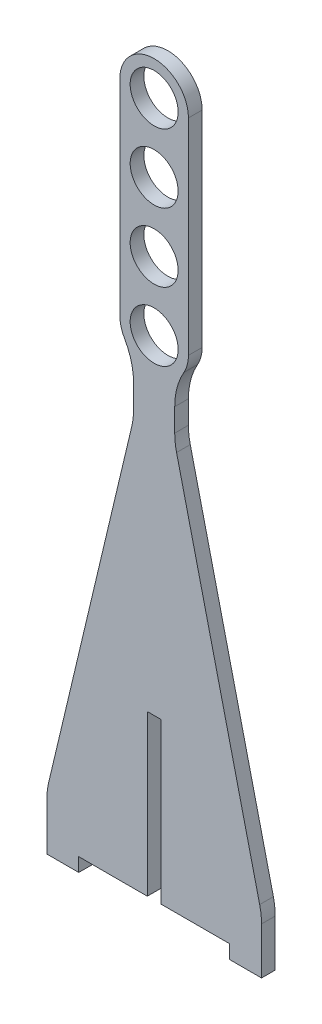
ISO-10303-21;
HEADER;
FILE_DESCRIPTION(('STEP AP214'),'2;1');
FILE_NAME('part.step','',(''),(''),'','','');
FILE_SCHEMA(('AUTOMOTIVE_DESIGN { 1 0 10303 214 1 1 1 1 }'));
ENDSEC;
DATA;
#1=APPLICATION_CONTEXT('core data for automotive mechanical design processes');
#2=APPLICATION_PROTOCOL_DEFINITION('international standard','automotive_design',2000,#1);
#3=PRODUCT_CONTEXT('',#1,'mechanical');
#4=PRODUCT('Part','Part','',(#3));
#5=PRODUCT_RELATED_PRODUCT_CATEGORY('part','',(#4));
#6=PRODUCT_DEFINITION_FORMATION('','',#4);
#7=PRODUCT_DEFINITION_CONTEXT('part definition',#1,'design');
#8=PRODUCT_DEFINITION('design','',#6,#7);
#9=PRODUCT_DEFINITION_SHAPE('','',#8);
#10=(LENGTH_UNIT() NAMED_UNIT(*) SI_UNIT(.MILLI.,.METRE.));
#11=(NAMED_UNIT(*) PLANE_ANGLE_UNIT() SI_UNIT($,.RADIAN.));
#12=(NAMED_UNIT(*) SI_UNIT($,.STERADIAN.) SOLID_ANGLE_UNIT());
#13=UNCERTAINTY_MEASURE_WITH_UNIT(LENGTH_MEASURE(1.E-05),#10,'distance_accuracy_value','');
#14=(GEOMETRIC_REPRESENTATION_CONTEXT(3) GLOBAL_UNCERTAINTY_ASSIGNED_CONTEXT((#13)) GLOBAL_UNIT_ASSIGNED_CONTEXT((#10,
#11,#12)) REPRESENTATION_CONTEXT('',''));
#15=CARTESIAN_POINT('',(0.,0.,0.));
#16=DIRECTION('',(0.,0.,1.));
#17=DIRECTION('',(1.,0.,0.));
#18=AXIS2_PLACEMENT_3D('',#15,#16,#17);
#19=CARTESIAN_POINT('',(-16.5,3.,3.));
#20=DIRECTION('',(0.,1.,0.));
#21=DIRECTION('',(0.,0.,1.));
#22=AXIS2_PLACEMENT_3D('',#19,#20,#21);
#23=PLANE('',#22);
#24=DIRECTION('',(1.,0.,0.));
#25=VECTOR('',#24,1.);
#26=CARTESIAN_POINT('',(-16.5,3.,0.));
#27=LINE('',#26,#25);
#28=CARTESIAN_POINT('',(-16.5,3.,0.));
#29=VERTEX_POINT('',#28);
#30=CARTESIAN_POINT('',(-1.5,3.,0.));
#31=VERTEX_POINT('',#30);
#32=EDGE_CURVE('E231',#29,#31,#27,.T.);
#33=ORIENTED_EDGE('',*,*,#32,.T.);
#34=DIRECTION('',(0.,0.,1.));
#35=VECTOR('',#34,1.);
#36=CARTESIAN_POINT('',(-1.5,3.,0.));
#37=LINE('',#36,#35);
#38=CARTESIAN_POINT('',(-1.5,3.,3.));
#39=VERTEX_POINT('',#38);
#40=EDGE_CURVE('E212',#31,#39,#37,.T.);
#41=ORIENTED_EDGE('',*,*,#40,.T.);
#42=DIRECTION('',(1.,0.,0.));
#43=VECTOR('',#42,1.);
#44=CARTESIAN_POINT('',(-16.5,3.,3.));
#45=LINE('',#44,#43);
#46=CARTESIAN_POINT('',(-16.5,3.,3.));
#47=VERTEX_POINT('',#46);
#48=EDGE_CURVE('E363',#47,#39,#45,.T.);
#49=ORIENTED_EDGE('',*,*,#48,.F.);
#50=DIRECTION('',(0.,0.,-1.));
#51=VECTOR('',#50,1.);
#52=CARTESIAN_POINT('',(-16.5,3.,3.));
#53=LINE('',#52,#51);
#54=EDGE_CURVE('E237',#47,#29,#53,.T.);
#55=ORIENTED_EDGE('',*,*,#54,.T.);
#56=EDGE_LOOP('',(#33,#41,#49,#55));
#57=FACE_BOUND('',#56,.T.);
#58=ADVANCED_FACE('F39',(#57),#23,.F.);
#59=CARTESIAN_POINT('',(0.,110.,3.));
#60=DIRECTION('',(0.,0.,1.));
#61=DIRECTION('',(1.,0.,0.));
#62=AXIS2_PLACEMENT_3D('',#59,#60,#61);
#63=PLANE('',#62);
#64=DIRECTION('',(0.,-1.,0.));
#65=VECTOR('',#64,1.);
#66=CARTESIAN_POINT('',(-1.5,38.,3.));
#67=LINE('',#66,#65);
#68=CARTESIAN_POINT('',(-1.5,38.,3.));
#69=VERTEX_POINT('',#68);
#70=EDGE_CURVE('E218',#69,#39,#67,.T.);
#71=ORIENTED_EDGE('',*,*,#70,.F.);
#72=DIRECTION('',(-1.,0.,0.));
#73=VECTOR('',#72,1.);
#74=CARTESIAN_POINT('',(1.5,38.,3.));
#75=LINE('',#74,#73);
#76=CARTESIAN_POINT('',(1.5,38.,3.));
#77=VERTEX_POINT('',#76);
#78=EDGE_CURVE('E233',#77,#69,#75,.T.);
#79=ORIENTED_EDGE('',*,*,#78,.F.);
#80=DIRECTION('',(0.,1.,0.));
#81=VECTOR('',#80,1.);
#82=CARTESIAN_POINT('',(1.5,38.,3.));
#83=LINE('',#82,#81);
#84=CARTESIAN_POINT('',(1.5,3.,3.));
#85=VERTEX_POINT('',#84);
#86=EDGE_CURVE('E447',#85,#77,#83,.T.);
#87=ORIENTED_EDGE('',*,*,#86,.F.);
#88=CARTESIAN_POINT('',(16.5,3.,3.));
#89=VERTEX_POINT('',#88);
#90=EDGE_CURVE('E362',#85,#89,#45,.T.);
#91=ORIENTED_EDGE('',*,*,#90,.T.);
#92=DIRECTION('',(0.,-1.,0.));
#93=VECTOR('',#92,1.);
#94=CARTESIAN_POINT('',(16.5,0.,3.));
#95=LINE('',#94,#93);
#96=CARTESIAN_POINT('',(16.5,0.,3.));
#97=VERTEX_POINT('',#96);
#98=EDGE_CURVE('E365',#89,#97,#95,.T.);
#99=ORIENTED_EDGE('',*,*,#98,.T.);
#100=DIRECTION('',(1.,0.,0.));
#101=VECTOR('',#100,1.);
#102=CARTESIAN_POINT('',(23.5,0.,3.));
#103=LINE('',#102,#101);
#104=CARTESIAN_POINT('',(23.5,0.,3.));
#105=VERTEX_POINT('',#104);
#106=EDGE_CURVE('E253',#97,#105,#103,.T.);
#107=ORIENTED_EDGE('',*,*,#106,.T.);
#108=DIRECTION('',(0.,1.,0.));
#109=VECTOR('',#108,1.);
#110=CARTESIAN_POINT('',(23.5,0.,3.));
#111=LINE('',#110,#109);
#112=CARTESIAN_POINT('',(23.5,10.2431840189314,3.));
#113=VERTEX_POINT('',#112);
#114=EDGE_CURVE('E248',#105,#113,#111,.T.);
#115=ORIENTED_EDGE('',*,*,#114,.T.);
#116=CARTESIAN_POINT('',(8.5,10.2431840189314,3.));
#117=DIRECTION('',(0.,0.,1.));
#118=DIRECTION('',(1.,0.,0.));
#119=AXIS2_PLACEMENT_3D('',#116,#117,#118);
#120=CIRCLE('',#119,15.);
#121=CARTESIAN_POINT('',(23.0940482607934,13.7092704808699,3.));
#122=VERTEX_POINT('',#121);
#123=EDGE_CURVE('E302',#113,#122,#120,.T.);
#124=ORIENTED_EDGE('',*,*,#123,.T.);
#125=DIRECTION('',(-0.231072430795896,0.972936550719561,0.));
#126=VECTOR('',#125,1.);
#127=CARTESIAN_POINT('',(23.5,12.,3.));
#128=LINE('',#127,#126);
#129=CARTESIAN_POINT('',(4.90595173920659,90.2907295191301,3.));
#130=VERTEX_POINT('',#129);
#131=EDGE_CURVE('E484',#122,#130,#128,.T.);
#132=ORIENTED_EDGE('',*,*,#131,.T.);
#133=CARTESIAN_POINT('',(19.5,93.7568159810686,3.));
#134=DIRECTION('',(0.,0.,1.));
#135=DIRECTION('',(1.,0.,0.));
#136=AXIS2_PLACEMENT_3D('',#133,#134,#135);
#137=CIRCLE('',#136,15.);
#138=CARTESIAN_POINT('',(4.5,93.7568159810686,3.));
#139=VERTEX_POINT('',#138);
#140=EDGE_CURVE('E321',#130,#139,#137,.F.);
#141=ORIENTED_EDGE('',*,*,#140,.T.);
#142=DIRECTION('',(0.,1.,0.));
#143=VECTOR('',#142,1.);
#144=CARTESIAN_POINT('',(4.5,92.,3.));
#145=LINE('',#144,#143);
#146=CARTESIAN_POINT('',(4.5,98.7750278396782,3.));
#147=VERTEX_POINT('',#146);
#148=EDGE_CURVE('E487',#139,#147,#145,.T.);
#149=ORIENTED_EDGE('',*,*,#148,.T.);
#150=CARTESIAN_POINT('',(19.5,98.7750278396782,3.));
#151=DIRECTION('',(0.,0.,1.));
#152=DIRECTION('',(1.,0.,0.));
#153=AXIS2_PLACEMENT_3D('',#150,#151,#152);
#154=CIRCLE('',#153,15.);
#155=CARTESIAN_POINT('',(6.50000000000001,106.258342613226,3.));
#156=VERTEX_POINT('',#155);
#157=EDGE_CURVE('E325',#147,#156,#154,.F.);
#158=ORIENTED_EDGE('',*,*,#157,.T.);
#159=CARTESIAN_POINT('',(0.,110.,3.));
#160=DIRECTION('',(0.,0.,1.));
#161=DIRECTION('',(1.,0.,0.));
#162=AXIS2_PLACEMENT_3D('',#159,#160,#161);
#163=CIRCLE('',#162,7.5);
#164=CARTESIAN_POINT('',(7.5,110.,3.));
#165=VERTEX_POINT('',#164);
#166=EDGE_CURVE('E490',#156,#165,#163,.T.);
#167=ORIENTED_EDGE('',*,*,#166,.T.);
#168=DIRECTION('',(0.,1.,0.));
#169=VECTOR('',#168,1.);
#170=CARTESIAN_POINT('',(7.5,110.,3.));
#171=LINE('',#170,#169);
#172=CARTESIAN_POINT('',(7.4999999999999,155.,3.));
#173=VERTEX_POINT('',#172);
#174=EDGE_CURVE('E492',#165,#173,#171,.T.);
#175=ORIENTED_EDGE('',*,*,#174,.T.);
#176=CARTESIAN_POINT('',(-1.02907469966573E-13,155.,3.));
#177=DIRECTION('',(0.,0.,1.));
#178=DIRECTION('',(-1.,0.,0.));
#179=AXIS2_PLACEMENT_3D('',#176,#177,#178);
#180=CIRCLE('',#179,7.5);
#181=CARTESIAN_POINT('',(-7.5,155.,3.));
#182=VERTEX_POINT('',#181);
#183=EDGE_CURVE('E494',#173,#182,#180,.T.);
#184=ORIENTED_EDGE('',*,*,#183,.T.);
#185=DIRECTION('',(0.,-1.,0.));
#186=VECTOR('',#185,1.);
#187=CARTESIAN_POINT('',(-7.5,110.,3.));
#188=LINE('',#187,#186);
#189=CARTESIAN_POINT('',(-7.5,110.,3.));
#190=VERTEX_POINT('',#189);
#191=EDGE_CURVE('E496',#182,#190,#188,.T.);
#192=ORIENTED_EDGE('',*,*,#191,.T.);
#193=CARTESIAN_POINT('',(0.,110.,3.));
#194=DIRECTION('',(0.,0.,1.));
#195=DIRECTION('',(1.,0.,0.));
#196=AXIS2_PLACEMENT_3D('',#193,#194,#195);
#197=CIRCLE('',#196,7.5);
#198=CARTESIAN_POINT('',(-6.50000000000001,106.258342613226,3.));
#199=VERTEX_POINT('',#198);
#200=EDGE_CURVE('E355',#190,#199,#197,.T.);
#201=ORIENTED_EDGE('',*,*,#200,.T.);
#202=CARTESIAN_POINT('',(-19.5,98.7750278396782,3.));
#203=DIRECTION('',(0.,0.,1.));
#204=DIRECTION('',(1.,0.,0.));
#205=AXIS2_PLACEMENT_3D('',#202,#203,#204);
#206=CIRCLE('',#205,15.);
#207=CARTESIAN_POINT('',(-4.5,98.7750278396782,3.));
#208=VERTEX_POINT('',#207);
#209=EDGE_CURVE('E317',#199,#208,#206,.F.);
#210=ORIENTED_EDGE('',*,*,#209,.T.);
#211=DIRECTION('',(0.,-1.,0.));
#212=VECTOR('',#211,1.);
#213=CARTESIAN_POINT('',(-4.5,92.,3.));
#214=LINE('',#213,#212);
#215=CARTESIAN_POINT('',(-4.5,93.7568159810686,3.));
#216=VERTEX_POINT('',#215);
#217=EDGE_CURVE('E347',#208,#216,#214,.T.);
#218=ORIENTED_EDGE('',*,*,#217,.T.);
#219=CARTESIAN_POINT('',(-19.5,93.7568159810686,3.));
#220=DIRECTION('',(0.,0.,1.));
#221=DIRECTION('',(1.,0.,0.));
#222=AXIS2_PLACEMENT_3D('',#219,#220,#221);
#223=CIRCLE('',#222,15.);
#224=CARTESIAN_POINT('',(-4.90595173920659,90.2907295191301,3.));
#225=VERTEX_POINT('',#224);
#226=EDGE_CURVE('E11',#216,#225,#223,.F.);
#227=ORIENTED_EDGE('',*,*,#226,.T.);
#228=DIRECTION('',(-0.231072430795896,-0.972936550719561,0.));
#229=VECTOR('',#228,1.);
#230=CARTESIAN_POINT('',(-23.5,12.,3.));
#231=LINE('',#230,#229);
#232=CARTESIAN_POINT('',(-23.0940482607934,13.7092704808699,3.));
#233=VERTEX_POINT('',#232);
#234=EDGE_CURVE('E346',#225,#233,#231,.T.);
#235=ORIENTED_EDGE('',*,*,#234,.T.);
#236=CARTESIAN_POINT('',(-8.5,10.2431840189314,3.));
#237=DIRECTION('',(0.,0.,1.));
#238=DIRECTION('',(1.,0.,0.));
#239=AXIS2_PLACEMENT_3D('',#236,#237,#238);
#240=CIRCLE('',#239,15.);
#241=CARTESIAN_POINT('',(-23.5,10.2431840189314,3.));
#242=VERTEX_POINT('',#241);
#243=EDGE_CURVE('E62',#233,#242,#240,.T.);
#244=ORIENTED_EDGE('',*,*,#243,.T.);
#245=DIRECTION('',(0.,-1.,0.));
#246=VECTOR('',#245,1.);
#247=CARTESIAN_POINT('',(-23.5,0.,3.));
#248=LINE('',#247,#246);
#249=CARTESIAN_POINT('',(-23.5,0.,3.));
#250=VERTEX_POINT('',#249);
#251=EDGE_CURVE('E351',#242,#250,#248,.T.);
#252=ORIENTED_EDGE('',*,*,#251,.T.);
#253=DIRECTION('',(1.,0.,0.));
#254=VECTOR('',#253,1.);
#255=CARTESIAN_POINT('',(-23.5,0.,3.));
#256=LINE('',#255,#254);
#257=CARTESIAN_POINT('',(-16.5,0.,3.));
#258=VERTEX_POINT('',#257);
#259=EDGE_CURVE('E353',#250,#258,#256,.T.);
#260=ORIENTED_EDGE('',*,*,#259,.T.);
#261=DIRECTION('',(0.,1.,0.));
#262=VECTOR('',#261,1.);
#263=CARTESIAN_POINT('',(-16.5,0.,3.));
#264=LINE('',#263,#262);
#265=EDGE_CURVE('E360',#258,#47,#264,.T.);
#266=ORIENTED_EDGE('',*,*,#265,.T.);
#267=ORIENTED_EDGE('',*,*,#48,.T.);
#268=EDGE_LOOP('',(#71,#79,#87,#91,#99,#107,#115,#124,#132,#141,#149,#158,#167,#175,#184,#192,
#201,#210,#218,#227,#235,#244,#252,#260,#266,#267));
#269=FACE_BOUND('',#268,.T.);
#270=CARTESIAN_POINT('',(0.,140.,3.));
#271=DIRECTION('',(0.,0.,1.));
#272=DIRECTION('',(1.,0.,0.));
#273=AXIS2_PLACEMENT_3D('',#270,#271,#272);
#274=CIRCLE('',#273,5.25000000000001);
#275=CARTESIAN_POINT('',(5.24999999999996,140.,3.));
#276=VERTEX_POINT('',#275);
#277=EDGE_CURVE('E466',#276,#276,#274,.T.);
#278=ORIENTED_EDGE('',*,*,#277,.F.);
#279=EDGE_LOOP('',(#278));
#280=FACE_BOUND('',#279,.T.);
#281=CARTESIAN_POINT('',(0.,125.,3.));
#282=DIRECTION('',(0.,0.,1.));
#283=DIRECTION('',(1.,0.,0.));
#284=AXIS2_PLACEMENT_3D('',#281,#282,#283);
#285=CIRCLE('',#284,5.25);
#286=CARTESIAN_POINT('',(5.25,125.,3.));
#287=VERTEX_POINT('',#286);
#288=EDGE_CURVE('E372',#287,#287,#285,.T.);
#289=ORIENTED_EDGE('',*,*,#288,.F.);
#290=EDGE_LOOP('',(#289));
#291=FACE_BOUND('',#290,.T.);
#292=CARTESIAN_POINT('',(0.,110.,3.));
#293=DIRECTION('',(0.,0.,1.));
#294=DIRECTION('',(1.,0.,0.));
#295=AXIS2_PLACEMENT_3D('',#292,#293,#294);
#296=CIRCLE('',#295,5.25);
#297=CARTESIAN_POINT('',(5.25,110.,3.));
#298=VERTEX_POINT('',#297);
#299=EDGE_CURVE('E472',#298,#298,#296,.T.);
#300=ORIENTED_EDGE('',*,*,#299,.F.);
#301=EDGE_LOOP('',(#300));
#302=FACE_BOUND('',#301,.T.);
#303=CARTESIAN_POINT('',(-1.02907469966573E-13,155.,3.));
#304=DIRECTION('',(0.,0.,1.));
#305=DIRECTION('',(1.,0.,0.));
#306=AXIS2_PLACEMENT_3D('',#303,#304,#305);
#307=CIRCLE('',#306,5.25000000000001);
#308=CARTESIAN_POINT('',(5.2499999999999,155.,3.));
#309=VERTEX_POINT('',#308);
#310=EDGE_CURVE('E460',#309,#309,#307,.T.);
#311=ORIENTED_EDGE('',*,*,#310,.F.);
#312=EDGE_LOOP('',(#311));
#313=FACE_BOUND('',#312,.T.);
#314=ADVANCED_FACE('F344',(#269,#280,#291,#302,#313),#63,.T.);
#315=CARTESIAN_POINT('',(0.,110.,0.));
#316=DIRECTION('',(0.,0.,1.));
#317=DIRECTION('',(1.,0.,0.));
#318=AXIS2_PLACEMENT_3D('',#315,#316,#317);
#319=PLANE('',#318);
#320=DIRECTION('',(-1.,0.,0.));
#321=VECTOR('',#320,1.);
#322=CARTESIAN_POINT('',(1.5,38.,0.));
#323=LINE('',#322,#321);
#324=CARTESIAN_POINT('',(1.5,38.,0.));
#325=VERTEX_POINT('',#324);
#326=CARTESIAN_POINT('',(-1.5,38.,0.));
#327=VERTEX_POINT('',#326);
#328=EDGE_CURVE('E224',#325,#327,#323,.T.);
#329=ORIENTED_EDGE('',*,*,#328,.T.);
#330=DIRECTION('',(0.,-1.,0.));
#331=VECTOR('',#330,1.);
#332=CARTESIAN_POINT('',(-1.5,38.,0.));
#333=LINE('',#332,#331);
#334=EDGE_CURVE('E215',#327,#31,#333,.T.);
#335=ORIENTED_EDGE('',*,*,#334,.T.);
#336=ORIENTED_EDGE('',*,*,#32,.F.);
#337=DIRECTION('',(0.,1.,0.));
#338=VECTOR('',#337,1.);
#339=CARTESIAN_POINT('',(-16.5,0.,0.));
#340=LINE('',#339,#338);
#341=CARTESIAN_POINT('',(-16.5,0.,0.));
#342=VERTEX_POINT('',#341);
#343=EDGE_CURVE('E243',#342,#29,#340,.T.);
#344=ORIENTED_EDGE('',*,*,#343,.F.);
#345=DIRECTION('',(1.,0.,0.));
#346=VECTOR('',#345,1.);
#347=CARTESIAN_POINT('',(-23.5,0.,0.));
#348=LINE('',#347,#346);
#349=CARTESIAN_POINT('',(-23.5,0.,0.));
#350=VERTEX_POINT('',#349);
#351=EDGE_CURVE('E390',#350,#342,#348,.T.);
#352=ORIENTED_EDGE('',*,*,#351,.F.);
#353=DIRECTION('',(0.,-1.,0.));
#354=VECTOR('',#353,1.);
#355=CARTESIAN_POINT('',(-23.5,0.,0.));
#356=LINE('',#355,#354);
#357=CARTESIAN_POINT('',(-23.5,10.2431840189314,0.));
#358=VERTEX_POINT('',#357);
#359=EDGE_CURVE('E389',#358,#350,#356,.T.);
#360=ORIENTED_EDGE('',*,*,#359,.F.);
#361=CARTESIAN_POINT('',(-8.5,10.2431840189314,0.));
#362=DIRECTION('',(0.,0.,1.));
#363=DIRECTION('',(1.,0.,0.));
#364=AXIS2_PLACEMENT_3D('',#361,#362,#363);
#365=CIRCLE('',#364,15.);
#366=CARTESIAN_POINT('',(-23.0940482607934,13.7092704808699,0.));
#367=VERTEX_POINT('',#366);
#368=EDGE_CURVE('E295',#358,#367,#365,.F.);
#369=ORIENTED_EDGE('',*,*,#368,.T.);
#370=DIRECTION('',(-0.231072430795896,-0.972936550719561,0.));
#371=VECTOR('',#370,1.);
#372=CARTESIAN_POINT('',(-23.5,12.,0.));
#373=LINE('',#372,#371);
#374=CARTESIAN_POINT('',(-4.90595173920659,90.2907295191301,0.));
#375=VERTEX_POINT('',#374);
#376=EDGE_CURVE('E331',#375,#367,#373,.T.);
#377=ORIENTED_EDGE('',*,*,#376,.F.);
#378=CARTESIAN_POINT('',(-19.5,93.7568159810686,0.));
#379=DIRECTION('',(0.,0.,1.));
#380=DIRECTION('',(1.,0.,0.));
#381=AXIS2_PLACEMENT_3D('',#378,#379,#380);
#382=CIRCLE('',#381,15.);
#383=CARTESIAN_POINT('',(-4.5,93.7568159810686,0.));
#384=VERTEX_POINT('',#383);
#385=EDGE_CURVE('E47',#375,#384,#382,.T.);
#386=ORIENTED_EDGE('',*,*,#385,.T.);
#387=DIRECTION('',(0.,-1.,0.));
#388=VECTOR('',#387,1.);
#389=CARTESIAN_POINT('',(-4.5,92.,0.));
#390=LINE('',#389,#388);
#391=CARTESIAN_POINT('',(-4.5,98.7750278396782,0.));
#392=VERTEX_POINT('',#391);
#393=EDGE_CURVE('E329',#392,#384,#390,.T.);
#394=ORIENTED_EDGE('',*,*,#393,.F.);
#395=CARTESIAN_POINT('',(-19.5,98.7750278396782,0.));
#396=DIRECTION('',(0.,0.,1.));
#397=DIRECTION('',(1.,0.,0.));
#398=AXIS2_PLACEMENT_3D('',#395,#396,#397);
#399=CIRCLE('',#398,15.);
#400=CARTESIAN_POINT('',(-6.50000000000001,106.258342613226,0.));
#401=VERTEX_POINT('',#400);
#402=EDGE_CURVE('E315',#392,#401,#399,.T.);
#403=ORIENTED_EDGE('',*,*,#402,.T.);
#404=CARTESIAN_POINT('',(0.,110.,0.));
#405=DIRECTION('',(0.,0.,1.));
#406=DIRECTION('',(1.,0.,0.));
#407=AXIS2_PLACEMENT_3D('',#404,#405,#406);
#408=CIRCLE('',#407,7.5);
#409=CARTESIAN_POINT('',(-7.5,110.,0.));
#410=VERTEX_POINT('',#409);
#411=EDGE_CURVE('E340',#410,#401,#408,.T.);
#412=ORIENTED_EDGE('',*,*,#411,.F.);
#413=DIRECTION('',(0.,-1.,0.));
#414=VECTOR('',#413,1.);
#415=CARTESIAN_POINT('',(-7.5,110.,0.));
#416=LINE('',#415,#414);
#417=CARTESIAN_POINT('',(-7.5,155.,0.));
#418=VERTEX_POINT('',#417);
#419=EDGE_CURVE('E384',#418,#410,#416,.T.);
#420=ORIENTED_EDGE('',*,*,#419,.F.);
#421=CARTESIAN_POINT('',(-1.02907469966573E-13,155.,0.));
#422=DIRECTION('',(0.,0.,1.));
#423=DIRECTION('',(-1.,0.,0.));
#424=AXIS2_PLACEMENT_3D('',#421,#422,#423);
#425=CIRCLE('',#424,7.5);
#426=CARTESIAN_POINT('',(7.4999999999999,155.,0.));
#427=VERTEX_POINT('',#426);
#428=EDGE_CURVE('E382',#427,#418,#425,.T.);
#429=ORIENTED_EDGE('',*,*,#428,.F.);
#430=DIRECTION('',(0.,1.,0.));
#431=VECTOR('',#430,1.);
#432=CARTESIAN_POINT('',(7.5,110.,0.));
#433=LINE('',#432,#431);
#434=CARTESIAN_POINT('',(7.5,110.,0.));
#435=VERTEX_POINT('',#434);
#436=EDGE_CURVE('E380',#435,#427,#433,.T.);
#437=ORIENTED_EDGE('',*,*,#436,.F.);
#438=CARTESIAN_POINT('',(0.,110.,0.));
#439=DIRECTION('',(0.,0.,1.));
#440=DIRECTION('',(1.,0.,0.));
#441=AXIS2_PLACEMENT_3D('',#438,#439,#440);
#442=CIRCLE('',#441,7.5);
#443=CARTESIAN_POINT('',(6.50000000000001,106.258342613226,0.));
#444=VERTEX_POINT('',#443);
#445=EDGE_CURVE('E378',#444,#435,#442,.T.);
#446=ORIENTED_EDGE('',*,*,#445,.F.);
#447=CARTESIAN_POINT('',(19.5,98.7750278396782,0.));
#448=DIRECTION('',(0.,0.,1.));
#449=DIRECTION('',(1.,0.,0.));
#450=AXIS2_PLACEMENT_3D('',#447,#448,#449);
#451=CIRCLE('',#450,15.);
#452=CARTESIAN_POINT('',(4.5,98.7750278396782,0.));
#453=VERTEX_POINT('',#452);
#454=EDGE_CURVE('E323',#444,#453,#451,.T.);
#455=ORIENTED_EDGE('',*,*,#454,.T.);
#456=DIRECTION('',(0.,1.,0.));
#457=VECTOR('',#456,1.);
#458=CARTESIAN_POINT('',(4.5,92.,0.));
#459=LINE('',#458,#457);
#460=CARTESIAN_POINT('',(4.5,93.7568159810686,0.));
#461=VERTEX_POINT('',#460);
#462=EDGE_CURVE('E375',#461,#453,#459,.T.);
#463=ORIENTED_EDGE('',*,*,#462,.F.);
#464=CARTESIAN_POINT('',(19.5,93.7568159810686,0.));
#465=DIRECTION('',(0.,0.,1.));
#466=DIRECTION('',(1.,0.,0.));
#467=AXIS2_PLACEMENT_3D('',#464,#465,#466);
#468=CIRCLE('',#467,15.);
#469=CARTESIAN_POINT('',(4.90595173920659,90.2907295191301,0.));
#470=VERTEX_POINT('',#469);
#471=EDGE_CURVE('E319',#461,#470,#468,.T.);
#472=ORIENTED_EDGE('',*,*,#471,.T.);
#473=DIRECTION('',(-0.231072430795896,0.972936550719561,0.));
#474=VECTOR('',#473,1.);
#475=CARTESIAN_POINT('',(23.5,12.,0.));
#476=LINE('',#475,#474);
#477=CARTESIAN_POINT('',(23.0940482607934,13.7092704808699,0.));
#478=VERTEX_POINT('',#477);
#479=EDGE_CURVE('E371',#478,#470,#476,.T.);
#480=ORIENTED_EDGE('',*,*,#479,.F.);
#481=CARTESIAN_POINT('',(8.5,10.2431840189314,0.));
#482=DIRECTION('',(0.,0.,1.));
#483=DIRECTION('',(1.,0.,0.));
#484=AXIS2_PLACEMENT_3D('',#481,#482,#483);
#485=CIRCLE('',#484,15.);
#486=CARTESIAN_POINT('',(23.5,10.2431840189314,0.));
#487=VERTEX_POINT('',#486);
#488=EDGE_CURVE('E297',#478,#487,#485,.F.);
#489=ORIENTED_EDGE('',*,*,#488,.T.);
#490=DIRECTION('',(0.,1.,0.));
#491=VECTOR('',#490,1.);
#492=CARTESIAN_POINT('',(23.5,0.,0.));
#493=LINE('',#492,#491);
#494=CARTESIAN_POINT('',(23.5,0.,0.));
#495=VERTEX_POINT('',#494);
#496=EDGE_CURVE('E368',#495,#487,#493,.T.);
#497=ORIENTED_EDGE('',*,*,#496,.F.);
#498=DIRECTION('',(1.,0.,0.));
#499=VECTOR('',#498,1.);
#500=CARTESIAN_POINT('',(23.5,0.,0.));
#501=LINE('',#500,#499);
#502=CARTESIAN_POINT('',(16.5,0.,0.));
#503=VERTEX_POINT('',#502);
#504=EDGE_CURVE('E241',#503,#495,#501,.T.);
#505=ORIENTED_EDGE('',*,*,#504,.F.);
#506=DIRECTION('',(0.,-1.,0.));
#507=VECTOR('',#506,1.);
#508=CARTESIAN_POINT('',(16.5,0.,0.));
#509=LINE('',#508,#507);
#510=CARTESIAN_POINT('',(16.5,3.,0.));
#511=VERTEX_POINT('',#510);
#512=EDGE_CURVE('E238',#511,#503,#509,.T.);
#513=ORIENTED_EDGE('',*,*,#512,.F.);
#514=CARTESIAN_POINT('',(1.5,3.,0.));
#515=VERTEX_POINT('',#514);
#516=EDGE_CURVE('E239',#515,#511,#27,.T.);
#517=ORIENTED_EDGE('',*,*,#516,.F.);
#518=DIRECTION('',(0.,1.,0.));
#519=VECTOR('',#518,1.);
#520=CARTESIAN_POINT('',(1.5,38.,0.));
#521=LINE('',#520,#519);
#522=EDGE_CURVE('E54',#515,#325,#521,.T.);
#523=ORIENTED_EDGE('',*,*,#522,.T.);
#524=EDGE_LOOP('',(#329,#335,#336,#344,#352,#360,#369,#377,#386,#394,#403,#412,#420,#429,#437,
#446,#455,#463,#472,#480,#489,#497,#505,#513,#517,#523));
#525=FACE_BOUND('',#524,.T.);
#526=CARTESIAN_POINT('',(0.,125.,0.));
#527=DIRECTION('',(0.,0.,1.));
#528=DIRECTION('',(1.,0.,0.));
#529=AXIS2_PLACEMENT_3D('',#526,#527,#528);
#530=CIRCLE('',#529,5.25);
#531=CARTESIAN_POINT('',(5.25,125.,0.));
#532=VERTEX_POINT('',#531);
#533=EDGE_CURVE('E475',#532,#532,#530,.T.);
#534=ORIENTED_EDGE('',*,*,#533,.T.);
#535=EDGE_LOOP('',(#534));
#536=FACE_BOUND('',#535,.T.);
#537=CARTESIAN_POINT('',(0.,110.,0.));
#538=DIRECTION('',(0.,0.,1.));
#539=DIRECTION('',(1.,0.,0.));
#540=AXIS2_PLACEMENT_3D('',#537,#538,#539);
#541=CIRCLE('',#540,5.25);
#542=CARTESIAN_POINT('',(5.25,110.,0.));
#543=VERTEX_POINT('',#542);
#544=EDGE_CURVE('E469',#543,#543,#541,.T.);
#545=ORIENTED_EDGE('',*,*,#544,.T.);
#546=EDGE_LOOP('',(#545));
#547=FACE_BOUND('',#546,.T.);
#548=CARTESIAN_POINT('',(0.,140.,0.));
#549=DIRECTION('',(0.,0.,1.));
#550=DIRECTION('',(1.,0.,0.));
#551=AXIS2_PLACEMENT_3D('',#548,#549,#550);
#552=CIRCLE('',#551,5.25000000000001);
#553=CARTESIAN_POINT('',(5.24999999999996,140.,0.));
#554=VERTEX_POINT('',#553);
#555=EDGE_CURVE('E463',#554,#554,#552,.T.);
#556=ORIENTED_EDGE('',*,*,#555,.T.);
#557=EDGE_LOOP('',(#556));
#558=FACE_BOUND('',#557,.T.);
#559=CARTESIAN_POINT('',(-1.02907469966573E-13,155.,0.));
#560=DIRECTION('',(0.,0.,1.));
#561=DIRECTION('',(1.,0.,0.));
#562=AXIS2_PLACEMENT_3D('',#559,#560,#561);
#563=CIRCLE('',#562,5.25000000000001);
#564=CARTESIAN_POINT('',(5.2499999999999,155.,0.));
#565=VERTEX_POINT('',#564);
#566=EDGE_CURVE('E456',#565,#565,#563,.T.);
#567=ORIENTED_EDGE('',*,*,#566,.T.);
#568=EDGE_LOOP('',(#567));
#569=FACE_BOUND('',#568,.T.);
#570=ADVANCED_FACE('F228',(#525,#536,#547,#558,#569),#319,.F.);
#571=CARTESIAN_POINT('',(23.5,0.,3.));
#572=DIRECTION('',(-1.,0.,0.));
#573=DIRECTION('',(0.,0.,1.));
#574=AXIS2_PLACEMENT_3D('',#571,#572,#573);
#575=PLANE('',#574);
#576=ORIENTED_EDGE('',*,*,#496,.T.);
#577=DIRECTION('',(0.,0.,-1.));
#578=VECTOR('',#577,1.);
#579=CARTESIAN_POINT('',(23.5,10.2431840189314,3.));
#580=LINE('',#579,#578);
#581=EDGE_CURVE('E299',#487,#113,#580,.F.);
#582=ORIENTED_EDGE('',*,*,#581,.T.);
#583=ORIENTED_EDGE('',*,*,#114,.F.);
#584=DIRECTION('',(0.,0.,-1.));
#585=VECTOR('',#584,1.);
#586=CARTESIAN_POINT('',(23.5,0.,3.));
#587=LINE('',#586,#585);
#588=EDGE_CURVE('E249',#105,#495,#587,.T.);
#589=ORIENTED_EDGE('',*,*,#588,.T.);
#590=EDGE_LOOP('',(#576,#582,#583,#589));
#591=FACE_BOUND('',#590,.T.);
#592=ADVANCED_FACE('F547',(#591),#575,.F.);
#593=CARTESIAN_POINT('',(23.5,12.,3.));
#594=DIRECTION('',(-0.972936550719561,-0.231072430795896,0.));
#595=DIRECTION('',(0.231072430795896,-0.972936550719561,0.));
#596=AXIS2_PLACEMENT_3D('',#593,#594,#595);
#597=PLANE('',#596);
#598=ORIENTED_EDGE('',*,*,#479,.T.);
#599=DIRECTION('',(0.,0.,-1.));
#600=VECTOR('',#599,1.);
#601=CARTESIAN_POINT('',(4.90595173920659,90.2907295191301,3.));
#602=LINE('',#601,#600);
#603=EDGE_CURVE('E293',#470,#130,#602,.F.);
#604=ORIENTED_EDGE('',*,*,#603,.T.);
#605=ORIENTED_EDGE('',*,*,#131,.F.);
#606=DIRECTION('',(0.,0.,-1.));
#607=VECTOR('',#606,1.);
#608=CARTESIAN_POINT('',(23.0940482607934,13.7092704808699,3.));
#609=LINE('',#608,#607);
#610=EDGE_CURVE('E290',#122,#478,#609,.T.);
#611=ORIENTED_EDGE('',*,*,#610,.T.);
#612=EDGE_LOOP('',(#598,#604,#605,#611));
#613=FACE_BOUND('',#612,.T.);
#614=ADVANCED_FACE('F539',(#613),#597,.F.);
#615=CARTESIAN_POINT('',(4.5,92.,3.));
#616=DIRECTION('',(-1.,0.,0.));
#617=DIRECTION('',(0.,0.,1.));
#618=AXIS2_PLACEMENT_3D('',#615,#616,#617);
#619=PLANE('',#618);
#620=ORIENTED_EDGE('',*,*,#148,.F.);
#621=DIRECTION('',(0.,0.,-1.));
#622=VECTOR('',#621,1.);
#623=CARTESIAN_POINT('',(4.5,93.7568159810686,0.));
#624=LINE('',#623,#622);
#625=EDGE_CURVE('E287',#139,#461,#624,.T.);
#626=ORIENTED_EDGE('',*,*,#625,.T.);
#627=ORIENTED_EDGE('',*,*,#462,.T.);
#628=DIRECTION('',(0.,0.,1.));
#629=VECTOR('',#628,1.);
#630=CARTESIAN_POINT('',(4.5,98.7750278396782,3.));
#631=LINE('',#630,#629);
#632=EDGE_CURVE('E285',#453,#147,#631,.T.);
#633=ORIENTED_EDGE('',*,*,#632,.T.);
#634=EDGE_LOOP('',(#620,#626,#627,#633));
#635=FACE_BOUND('',#634,.T.);
#636=ADVANCED_FACE('F531',(#635),#619,.F.);
#637=CARTESIAN_POINT('',(0.,110.,3.));
#638=DIRECTION('',(0.,0.,-1.));
#639=DIRECTION('',(-1.,0.,0.));
#640=AXIS2_PLACEMENT_3D('',#637,#638,#639);
#641=CYLINDRICAL_SURFACE('',#640,7.5);
#642=ORIENTED_EDGE('',*,*,#166,.F.);
#643=DIRECTION('',(0.,0.,-1.));
#644=VECTOR('',#643,1.);
#645=CARTESIAN_POINT('',(6.50000000000001,106.258342613226,3.));
#646=LINE('',#645,#644);
#647=EDGE_CURVE('E312',#156,#444,#646,.T.);
#648=ORIENTED_EDGE('',*,*,#647,.T.);
#649=ORIENTED_EDGE('',*,*,#445,.T.);
#650=DIRECTION('',(0.,0.,-1.));
#651=VECTOR('',#650,1.);
#652=CARTESIAN_POINT('',(7.5,110.,3.));
#653=LINE('',#652,#651);
#654=EDGE_CURVE('E275',#165,#435,#653,.T.);
#655=ORIENTED_EDGE('',*,*,#654,.F.);
#656=EDGE_LOOP('',(#642,#648,#649,#655));
#657=FACE_BOUND('',#656,.T.);
#658=ADVANCED_FACE('F525',(#657),#641,.T.);
#659=CARTESIAN_POINT('',(7.5,110.,3.));
#660=DIRECTION('',(-1.,0.,0.));
#661=DIRECTION('',(0.,-1.,0.));
#662=AXIS2_PLACEMENT_3D('',#659,#660,#661);
#663=PLANE('',#662);
#664=ORIENTED_EDGE('',*,*,#436,.T.);
#665=DIRECTION('',(0.,0.,-1.));
#666=VECTOR('',#665,1.);
#667=CARTESIAN_POINT('',(7.4999999999999,155.,3.));
#668=LINE('',#667,#666);
#669=EDGE_CURVE('E272',#173,#427,#668,.T.);
#670=ORIENTED_EDGE('',*,*,#669,.F.);
#671=ORIENTED_EDGE('',*,*,#174,.F.);
#672=ORIENTED_EDGE('',*,*,#654,.T.);
#673=EDGE_LOOP('',(#664,#670,#671,#672));
#674=FACE_BOUND('',#673,.T.);
#675=ADVANCED_FACE('F521',(#674),#663,.F.);
#676=CARTESIAN_POINT('',(-1.02907469966573E-13,155.,3.));
#677=DIRECTION('',(0.,0.,-1.));
#678=DIRECTION('',(-1.,0.,0.));
#679=AXIS2_PLACEMENT_3D('',#676,#677,#678);
#680=CYLINDRICAL_SURFACE('',#679,7.5);
#681=ORIENTED_EDGE('',*,*,#428,.T.);
#682=DIRECTION('',(0.,0.,-1.));
#683=VECTOR('',#682,1.);
#684=CARTESIAN_POINT('',(-7.5,155.,3.));
#685=LINE('',#684,#683);
#686=EDGE_CURVE('E269',#182,#418,#685,.T.);
#687=ORIENTED_EDGE('',*,*,#686,.F.);
#688=ORIENTED_EDGE('',*,*,#183,.F.);
#689=ORIENTED_EDGE('',*,*,#669,.T.);
#690=EDGE_LOOP('',(#681,#687,#688,#689));
#691=FACE_BOUND('',#690,.T.);
#692=ADVANCED_FACE('F516',(#691),#680,.T.);
#693=CARTESIAN_POINT('',(-7.5,110.,3.));
#694=DIRECTION('',(1.,0.,0.));
#695=DIRECTION('',(0.,1.,0.));
#696=AXIS2_PLACEMENT_3D('',#693,#694,#695);
#697=PLANE('',#696);
#698=ORIENTED_EDGE('',*,*,#419,.T.);
#699=DIRECTION('',(0.,0.,-1.));
#700=VECTOR('',#699,1.);
#701=CARTESIAN_POINT('',(-7.5,110.,3.));
#702=LINE('',#701,#700);
#703=EDGE_CURVE('E266',#190,#410,#702,.T.);
#704=ORIENTED_EDGE('',*,*,#703,.F.);
#705=ORIENTED_EDGE('',*,*,#191,.F.);
#706=ORIENTED_EDGE('',*,*,#686,.T.);
#707=EDGE_LOOP('',(#698,#704,#705,#706));
#708=FACE_BOUND('',#707,.T.);
#709=ADVANCED_FACE('F510',(#708),#697,.F.);
#710=CARTESIAN_POINT('',(0.,110.,3.));
#711=DIRECTION('',(0.,0.,-1.));
#712=DIRECTION('',(-1.,0.,0.));
#713=AXIS2_PLACEMENT_3D('',#710,#711,#712);
#714=CYLINDRICAL_SURFACE('',#713,7.5);
#715=ORIENTED_EDGE('',*,*,#411,.T.);
#716=DIRECTION('',(0.,0.,-1.));
#717=VECTOR('',#716,1.);
#718=CARTESIAN_POINT('',(-6.50000000000001,106.258342613226,3.));
#719=LINE('',#718,#717);
#720=EDGE_CURVE('E283',#401,#199,#719,.F.);
#721=ORIENTED_EDGE('',*,*,#720,.T.);
#722=ORIENTED_EDGE('',*,*,#200,.F.);
#723=ORIENTED_EDGE('',*,*,#703,.T.);
#724=EDGE_LOOP('',(#715,#721,#722,#723));
#725=FACE_BOUND('',#724,.T.);
#726=ADVANCED_FACE('F508',(#725),#714,.T.);
#727=CARTESIAN_POINT('',(-4.5,92.,3.));
#728=DIRECTION('',(1.,0.,0.));
#729=DIRECTION('',(0.,0.,-1.));
#730=AXIS2_PLACEMENT_3D('',#727,#728,#729);
#731=PLANE('',#730);
#732=ORIENTED_EDGE('',*,*,#217,.F.);
#733=DIRECTION('',(0.,0.,1.));
#734=VECTOR('',#733,1.);
#735=CARTESIAN_POINT('',(-4.5,98.7750278396782,0.));
#736=LINE('',#735,#734);
#737=EDGE_CURVE('E280',#208,#392,#736,.F.);
#738=ORIENTED_EDGE('',*,*,#737,.T.);
#739=ORIENTED_EDGE('',*,*,#393,.T.);
#740=DIRECTION('',(0.,0.,-1.));
#741=VECTOR('',#740,1.);
#742=CARTESIAN_POINT('',(-4.5,93.7568159810686,3.));
#743=LINE('',#742,#741);
#744=EDGE_CURVE('E278',#384,#216,#743,.F.);
#745=ORIENTED_EDGE('',*,*,#744,.T.);
#746=EDGE_LOOP('',(#732,#738,#739,#745));
#747=FACE_BOUND('',#746,.T.);
#748=ADVANCED_FACE('F337',(#747),#731,.F.);
#749=CARTESIAN_POINT('',(-23.5,12.,3.));
#750=DIRECTION('',(0.972936550719561,-0.231072430795896,0.));
#751=DIRECTION('',(0.231072430795896,0.972936550719561,0.));
#752=AXIS2_PLACEMENT_3D('',#749,#750,#751);
#753=PLANE('',#752);
#754=ORIENTED_EDGE('',*,*,#376,.T.);
#755=DIRECTION('',(0.,0.,-1.));
#756=VECTOR('',#755,1.);
#757=CARTESIAN_POINT('',(-23.0940482607934,13.7092704808699,3.));
#758=LINE('',#757,#756);
#759=EDGE_CURVE('E310',#367,#233,#758,.F.);
#760=ORIENTED_EDGE('',*,*,#759,.T.);
#761=ORIENTED_EDGE('',*,*,#234,.F.);
#762=DIRECTION('',(0.,0.,-1.));
#763=VECTOR('',#762,1.);
#764=CARTESIAN_POINT('',(-4.90595173920659,90.2907295191301,0.));
#765=LINE('',#764,#763);
#766=EDGE_CURVE('E307',#225,#375,#765,.T.);
#767=ORIENTED_EDGE('',*,*,#766,.T.);
#768=EDGE_LOOP('',(#754,#760,#761,#767));
#769=FACE_BOUND('',#768,.T.);
#770=ADVANCED_FACE('F349',(#769),#753,.F.);
#771=CARTESIAN_POINT('',(-23.5,0.,3.));
#772=DIRECTION('',(1.,0.,0.));
#773=DIRECTION('',(0.,0.,-1.));
#774=AXIS2_PLACEMENT_3D('',#771,#772,#773);
#775=PLANE('',#774);
#776=ORIENTED_EDGE('',*,*,#251,.F.);
#777=DIRECTION('',(0.,0.,-1.));
#778=VECTOR('',#777,1.);
#779=CARTESIAN_POINT('',(-23.5,10.2431840189314,3.));
#780=LINE('',#779,#778);
#781=EDGE_CURVE('E304',#242,#358,#780,.T.);
#782=ORIENTED_EDGE('',*,*,#781,.T.);
#783=ORIENTED_EDGE('',*,*,#359,.T.);
#784=DIRECTION('',(0.,0.,-1.));
#785=VECTOR('',#784,1.);
#786=CARTESIAN_POINT('',(-23.5,0.,3.));
#787=LINE('',#786,#785);
#788=EDGE_CURVE('E263',#250,#350,#787,.T.);
#789=ORIENTED_EDGE('',*,*,#788,.F.);
#790=EDGE_LOOP('',(#776,#782,#783,#789));
#791=FACE_BOUND('',#790,.T.);
#792=ADVANCED_FACE('F400',(#791),#775,.F.);
#793=CARTESIAN_POINT('',(-23.5,0.,3.));
#794=DIRECTION('',(0.,1.,0.));
#795=DIRECTION('',(0.,0.,1.));
#796=AXIS2_PLACEMENT_3D('',#793,#794,#795);
#797=PLANE('',#796);
#798=ORIENTED_EDGE('',*,*,#351,.T.);
#799=DIRECTION('',(0.,0.,-1.));
#800=VECTOR('',#799,1.);
#801=CARTESIAN_POINT('',(-16.5,0.,3.));
#802=LINE('',#801,#800);
#803=EDGE_CURVE('E260',#258,#342,#802,.T.);
#804=ORIENTED_EDGE('',*,*,#803,.F.);
#805=ORIENTED_EDGE('',*,*,#259,.F.);
#806=ORIENTED_EDGE('',*,*,#788,.T.);
#807=EDGE_LOOP('',(#798,#804,#805,#806));
#808=FACE_BOUND('',#807,.T.);
#809=ADVANCED_FACE('F403',(#808),#797,.F.);
#810=CARTESIAN_POINT('',(-16.5,0.,3.));
#811=DIRECTION('',(-1.,0.,0.));
#812=DIRECTION('',(0.,0.,1.));
#813=AXIS2_PLACEMENT_3D('',#810,#811,#812);
#814=PLANE('',#813);
#815=ORIENTED_EDGE('',*,*,#343,.T.);
#816=ORIENTED_EDGE('',*,*,#54,.F.);
#817=ORIENTED_EDGE('',*,*,#265,.F.);
#818=ORIENTED_EDGE('',*,*,#803,.T.);
#819=EDGE_LOOP('',(#815,#816,#817,#818));
#820=FACE_BOUND('',#819,.T.);
#821=ADVANCED_FACE('F395',(#820),#814,.F.);
#822=ORIENTED_EDGE('',*,*,#90,.F.);
#823=DIRECTION('',(0.,0.,1.));
#824=VECTOR('',#823,1.);
#825=CARTESIAN_POINT('',(1.5,3.,0.));
#826=LINE('',#825,#824);
#827=EDGE_CURVE('E223',#515,#85,#826,.T.);
#828=ORIENTED_EDGE('',*,*,#827,.F.);
#829=ORIENTED_EDGE('',*,*,#516,.T.);
#830=DIRECTION('',(0.,0.,-1.));
#831=VECTOR('',#830,1.);
#832=CARTESIAN_POINT('',(16.5,3.,3.));
#833=LINE('',#832,#831);
#834=EDGE_CURVE('E256',#89,#511,#833,.T.);
#835=ORIENTED_EDGE('',*,*,#834,.F.);
#836=EDGE_LOOP('',(#822,#828,#829,#835));
#837=FACE_BOUND('',#836,.T.);
#838=ADVANCED_FACE('F420',(#837),#23,.F.);
#839=CARTESIAN_POINT('',(16.5,0.,3.));
#840=DIRECTION('',(1.,0.,0.));
#841=DIRECTION('',(0.,0.,-1.));
#842=AXIS2_PLACEMENT_3D('',#839,#840,#841);
#843=PLANE('',#842);
#844=ORIENTED_EDGE('',*,*,#512,.T.);
#845=DIRECTION('',(0.,0.,-1.));
#846=VECTOR('',#845,1.);
#847=CARTESIAN_POINT('',(16.5,0.,3.));
#848=LINE('',#847,#846);
#849=EDGE_CURVE('E252',#97,#503,#848,.T.);
#850=ORIENTED_EDGE('',*,*,#849,.F.);
#851=ORIENTED_EDGE('',*,*,#98,.F.);
#852=ORIENTED_EDGE('',*,*,#834,.T.);
#853=EDGE_LOOP('',(#844,#850,#851,#852));
#854=FACE_BOUND('',#853,.T.);
#855=ADVANCED_FACE('F429',(#854),#843,.F.);
#856=CARTESIAN_POINT('',(23.5,0.,3.));
#857=DIRECTION('',(0.,1.,0.));
#858=DIRECTION('',(0.,0.,1.));
#859=AXIS2_PLACEMENT_3D('',#856,#857,#858);
#860=PLANE('',#859);
#861=ORIENTED_EDGE('',*,*,#504,.T.);
#862=ORIENTED_EDGE('',*,*,#588,.F.);
#863=ORIENTED_EDGE('',*,*,#106,.F.);
#864=ORIENTED_EDGE('',*,*,#849,.T.);
#865=EDGE_LOOP('',(#861,#862,#863,#864));
#866=FACE_BOUND('',#865,.T.);
#867=ADVANCED_FACE('F436',(#866),#860,.F.);
#868=CARTESIAN_POINT('',(0.,125.,3.));
#869=DIRECTION('',(0.,0.,-1.));
#870=DIRECTION('',(-1.,0.,0.));
#871=AXIS2_PLACEMENT_3D('',#868,#869,#870);
#872=CYLINDRICAL_SURFACE('',#871,5.25);
#873=ORIENTED_EDGE('',*,*,#288,.T.);
#874=EDGE_LOOP('',(#873));
#875=FACE_BOUND('',#874,.T.);
#876=ORIENTED_EDGE('',*,*,#533,.F.);
#877=EDGE_LOOP('',(#876));
#878=FACE_BOUND('',#877,.T.);
#879=ADVANCED_FACE('F555',(#875,#878),#872,.F.);
#880=CARTESIAN_POINT('',(0.,110.,3.));
#881=DIRECTION('',(0.,0.,-1.));
#882=DIRECTION('',(-1.,0.,0.));
#883=AXIS2_PLACEMENT_3D('',#880,#881,#882);
#884=CYLINDRICAL_SURFACE('',#883,5.25);
#885=ORIENTED_EDGE('',*,*,#299,.T.);
#886=EDGE_LOOP('',(#885));
#887=FACE_BOUND('',#886,.T.);
#888=ORIENTED_EDGE('',*,*,#544,.F.);
#889=EDGE_LOOP('',(#888));
#890=FACE_BOUND('',#889,.T.);
#891=ADVANCED_FACE('F560',(#887,#890),#884,.F.);
#892=CARTESIAN_POINT('',(0.,140.,3.));
#893=DIRECTION('',(0.,0.,-1.));
#894=DIRECTION('',(-1.,0.,0.));
#895=AXIS2_PLACEMENT_3D('',#892,#893,#894);
#896=CYLINDRICAL_SURFACE('',#895,5.25000000000001);
#897=ORIENTED_EDGE('',*,*,#277,.T.);
#898=EDGE_LOOP('',(#897));
#899=FACE_BOUND('',#898,.T.);
#900=ORIENTED_EDGE('',*,*,#555,.F.);
#901=EDGE_LOOP('',(#900));
#902=FACE_BOUND('',#901,.T.);
#903=ADVANCED_FACE('F567',(#899,#902),#896,.F.);
#904=CARTESIAN_POINT('',(-1.02907469966573E-13,155.,3.));
#905=DIRECTION('',(0.,0.,-1.));
#906=DIRECTION('',(-1.,0.,0.));
#907=AXIS2_PLACEMENT_3D('',#904,#905,#906);
#908=CYLINDRICAL_SURFACE('',#907,5.25000000000001);
#909=ORIENTED_EDGE('',*,*,#310,.T.);
#910=EDGE_LOOP('',(#909));
#911=FACE_BOUND('',#910,.T.);
#912=ORIENTED_EDGE('',*,*,#566,.F.);
#913=EDGE_LOOP('',(#912));
#914=FACE_BOUND('',#913,.T.);
#915=ADVANCED_FACE('F571',(#911,#914),#908,.F.);
#916=CARTESIAN_POINT('',(-19.5,98.7750278396782,3.));
#917=DIRECTION('',(0.,0.,-1.));
#918=DIRECTION('',(-1.,0.,0.));
#919=AXIS2_PLACEMENT_3D('',#916,#917,#918);
#920=CYLINDRICAL_SURFACE('',#919,15.);
#921=ORIENTED_EDGE('',*,*,#209,.F.);
#922=ORIENTED_EDGE('',*,*,#720,.F.);
#923=ORIENTED_EDGE('',*,*,#402,.F.);
#924=ORIENTED_EDGE('',*,*,#737,.F.);
#925=EDGE_LOOP('',(#921,#922,#923,#924));
#926=FACE_BOUND('',#925,.T.);
#927=ADVANCED_FACE('F505',(#926),#920,.F.);
#928=CARTESIAN_POINT('',(19.5,93.7568159810686,3.));
#929=DIRECTION('',(0.,0.,1.));
#930=DIRECTION('',(1.,0.,0.));
#931=AXIS2_PLACEMENT_3D('',#928,#929,#930);
#932=CYLINDRICAL_SURFACE('',#931,15.);
#933=ORIENTED_EDGE('',*,*,#140,.F.);
#934=ORIENTED_EDGE('',*,*,#603,.F.);
#935=ORIENTED_EDGE('',*,*,#471,.F.);
#936=ORIENTED_EDGE('',*,*,#625,.F.);
#937=EDGE_LOOP('',(#933,#934,#935,#936));
#938=FACE_BOUND('',#937,.T.);
#939=ADVANCED_FACE('F415',(#938),#932,.F.);
#940=CARTESIAN_POINT('',(8.5,10.2431840189314,3.));
#941=DIRECTION('',(0.,0.,-1.));
#942=DIRECTION('',(-1.,0.,0.));
#943=AXIS2_PLACEMENT_3D('',#940,#941,#942);
#944=CYLINDRICAL_SURFACE('',#943,15.);
#945=ORIENTED_EDGE('',*,*,#123,.F.);
#946=ORIENTED_EDGE('',*,*,#581,.F.);
#947=ORIENTED_EDGE('',*,*,#488,.F.);
#948=ORIENTED_EDGE('',*,*,#610,.F.);
#949=EDGE_LOOP('',(#945,#946,#947,#948));
#950=FACE_BOUND('',#949,.T.);
#951=ADVANCED_FACE('F408',(#950),#944,.T.);
#952=CARTESIAN_POINT('',(-8.5,10.2431840189314,3.));
#953=DIRECTION('',(0.,0.,-1.));
#954=DIRECTION('',(-1.,0.,0.));
#955=AXIS2_PLACEMENT_3D('',#952,#953,#954);
#956=CYLINDRICAL_SURFACE('',#955,15.);
#957=ORIENTED_EDGE('',*,*,#243,.F.);
#958=ORIENTED_EDGE('',*,*,#759,.F.);
#959=ORIENTED_EDGE('',*,*,#368,.F.);
#960=ORIENTED_EDGE('',*,*,#781,.F.);
#961=EDGE_LOOP('',(#957,#958,#959,#960));
#962=FACE_BOUND('',#961,.T.);
#963=ADVANCED_FACE('F405',(#962),#956,.T.);
#964=CARTESIAN_POINT('',(19.5,98.7750278396782,3.));
#965=DIRECTION('',(0.,0.,-1.));
#966=DIRECTION('',(-1.,0.,0.));
#967=AXIS2_PLACEMENT_3D('',#964,#965,#966);
#968=CYLINDRICAL_SURFACE('',#967,15.);
#969=ORIENTED_EDGE('',*,*,#157,.F.);
#970=ORIENTED_EDGE('',*,*,#632,.F.);
#971=ORIENTED_EDGE('',*,*,#454,.F.);
#972=ORIENTED_EDGE('',*,*,#647,.F.);
#973=EDGE_LOOP('',(#969,#970,#971,#972));
#974=FACE_BOUND('',#973,.T.);
#975=ADVANCED_FACE('F407',(#974),#968,.F.);
#976=CARTESIAN_POINT('',(-19.5,93.7568159810686,3.));
#977=DIRECTION('',(0.,0.,1.));
#978=DIRECTION('',(1.,0.,0.));
#979=AXIS2_PLACEMENT_3D('',#976,#977,#978);
#980=CYLINDRICAL_SURFACE('',#979,15.);
#981=ORIENTED_EDGE('',*,*,#226,.F.);
#982=ORIENTED_EDGE('',*,*,#744,.F.);
#983=ORIENTED_EDGE('',*,*,#385,.F.);
#984=ORIENTED_EDGE('',*,*,#766,.F.);
#985=EDGE_LOOP('',(#981,#982,#983,#984));
#986=FACE_BOUND('',#985,.T.);
#987=ADVANCED_FACE('F41',(#986),#980,.F.);
#988=CARTESIAN_POINT('',(-1.5,38.,0.));
#989=DIRECTION('',(-1.,0.,0.));
#990=DIRECTION('',(0.,-1.,0.));
#991=AXIS2_PLACEMENT_3D('',#988,#989,#990);
#992=PLANE('',#991);
#993=ORIENTED_EDGE('',*,*,#70,.T.);
#994=ORIENTED_EDGE('',*,*,#40,.F.);
#995=ORIENTED_EDGE('',*,*,#334,.F.);
#996=DIRECTION('',(0.,0.,1.));
#997=VECTOR('',#996,1.);
#998=CARTESIAN_POINT('',(-1.5,38.,0.));
#999=LINE('',#998,#997);
#1000=EDGE_CURVE('E454',#327,#69,#999,.T.);
#1001=ORIENTED_EDGE('',*,*,#1000,.T.);
#1002=EDGE_LOOP('',(#993,#994,#995,#1001));
#1003=FACE_BOUND('',#1002,.T.);
#1004=ADVANCED_FACE('F214',(#1003),#992,.F.);
#1005=CARTESIAN_POINT('',(1.5,38.,0.));
#1006=DIRECTION('',(0.,1.,0.));
#1007=DIRECTION('',(0.,0.,1.));
#1008=AXIS2_PLACEMENT_3D('',#1005,#1006,#1007);
#1009=PLANE('',#1008);
#1010=ORIENTED_EDGE('',*,*,#78,.T.);
#1011=ORIENTED_EDGE('',*,*,#1000,.F.);
#1012=ORIENTED_EDGE('',*,*,#328,.F.);
#1013=DIRECTION('',(0.,0.,1.));
#1014=VECTOR('',#1013,1.);
#1015=CARTESIAN_POINT('',(1.5,38.,0.));
#1016=LINE('',#1015,#1014);
#1017=EDGE_CURVE('E457',#325,#77,#1016,.T.);
#1018=ORIENTED_EDGE('',*,*,#1017,.T.);
#1019=EDGE_LOOP('',(#1010,#1011,#1012,#1018));
#1020=FACE_BOUND('',#1019,.T.);
#1021=ADVANCED_FACE('F577',(#1020),#1009,.F.);
#1022=CARTESIAN_POINT('',(1.5,38.,0.));
#1023=DIRECTION('',(1.,0.,0.));
#1024=DIRECTION('',(0.,1.,0.));
#1025=AXIS2_PLACEMENT_3D('',#1022,#1023,#1024);
#1026=PLANE('',#1025);
#1027=ORIENTED_EDGE('',*,*,#86,.T.);
#1028=ORIENTED_EDGE('',*,*,#1017,.F.);
#1029=ORIENTED_EDGE('',*,*,#522,.F.);
#1030=ORIENTED_EDGE('',*,*,#827,.T.);
#1031=EDGE_LOOP('',(#1027,#1028,#1029,#1030));
#1032=FACE_BOUND('',#1031,.T.);
#1033=ADVANCED_FACE('F578',(#1032),#1026,.F.);
#1034=CLOSED_SHELL('',(#58,#314,#570,#592,#614,#636,#658,#675,#692,#709,#726,#748,#770,#792,
#809,#821,#838,#855,#867,#879,#891,#903,#915,#927,#939,#951,#963,#975,#987,#1004,#1021,#1033));
#1035=MANIFOLD_SOLID_BREP('B2',#1034);
#1036=ADVANCED_BREP_SHAPE_REPRESENTATION('',(#18,#1035),#14);
#1037=SHAPE_DEFINITION_REPRESENTATION(#9,#1036);
ENDSEC;
END-ISO-10303-21;
